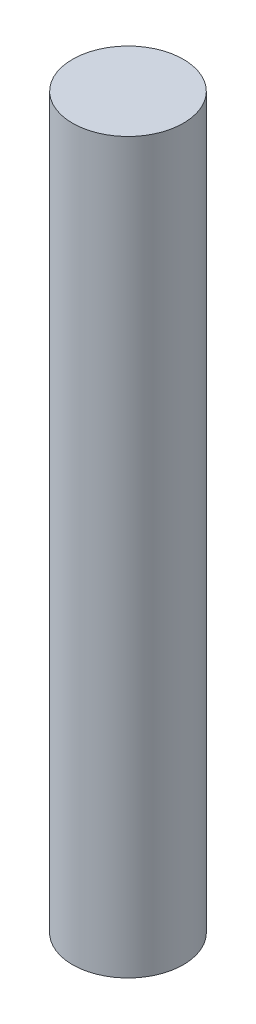
ISO-10303-21;
HEADER;
FILE_DESCRIPTION(('STEP AP214'),'2;1');
FILE_NAME('part.step','',(''),(''),'','','');
FILE_SCHEMA(('AUTOMOTIVE_DESIGN { 1 0 10303 214 1 1 1 1 }'));
ENDSEC;
DATA;
#1=APPLICATION_CONTEXT('core data for automotive mechanical design processes');
#2=APPLICATION_PROTOCOL_DEFINITION('international standard','automotive_design',2000,#1);
#3=PRODUCT_CONTEXT('',#1,'mechanical');
#4=PRODUCT('Part','Part','',(#3));
#5=PRODUCT_RELATED_PRODUCT_CATEGORY('part','',(#4));
#6=PRODUCT_DEFINITION_FORMATION('','',#4);
#7=PRODUCT_DEFINITION_CONTEXT('part definition',#1,'design');
#8=PRODUCT_DEFINITION('design','',#6,#7);
#9=PRODUCT_DEFINITION_SHAPE('','',#8);
#10=(LENGTH_UNIT() NAMED_UNIT(*) SI_UNIT(.MILLI.,.METRE.));
#11=(NAMED_UNIT(*) PLANE_ANGLE_UNIT() SI_UNIT($,.RADIAN.));
#12=(NAMED_UNIT(*) SI_UNIT($,.STERADIAN.) SOLID_ANGLE_UNIT());
#13=UNCERTAINTY_MEASURE_WITH_UNIT(LENGTH_MEASURE(1.E-05),#10,'distance_accuracy_value','');
#14=(GEOMETRIC_REPRESENTATION_CONTEXT(3) GLOBAL_UNCERTAINTY_ASSIGNED_CONTEXT((#13)) GLOBAL_UNIT_ASSIGNED_CONTEXT((#10,
#11,#12)) REPRESENTATION_CONTEXT('',''));
#15=CARTESIAN_POINT('',(0.,0.,0.));
#16=DIRECTION('',(0.,0.,1.));
#17=DIRECTION('',(1.,0.,0.));
#18=AXIS2_PLACEMENT_3D('',#15,#16,#17);
#19=CARTESIAN_POINT('',(0.,24.,0.));
#20=DIRECTION('',(0.,-1.,0.));
#21=DIRECTION('',(0.,0.,-1.));
#22=AXIS2_PLACEMENT_3D('',#19,#20,#21);
#23=CYLINDRICAL_SURFACE('',#22,1.825);
#24=CARTESIAN_POINT('',(0.,24.,0.));
#25=DIRECTION('',(0.,1.,0.));
#26=DIRECTION('',(0.,0.,1.));
#27=AXIS2_PLACEMENT_3D('',#24,#25,#26);
#28=CIRCLE('',#27,1.825);
#29=CARTESIAN_POINT('',(0.,24.,1.825));
#30=VERTEX_POINT('',#29);
#31=EDGE_CURVE('E10',#30,#30,#28,.T.);
#32=ORIENTED_EDGE('',*,*,#31,.F.);
#33=EDGE_LOOP('',(#32));
#34=FACE_BOUND('',#33,.T.);
#35=CARTESIAN_POINT('',(0.,0.,0.));
#36=DIRECTION('',(0.,1.,0.));
#37=DIRECTION('',(0.,0.,1.));
#38=AXIS2_PLACEMENT_3D('',#35,#36,#37);
#39=CIRCLE('',#38,1.825);
#40=CARTESIAN_POINT('',(0.,0.,1.825));
#41=VERTEX_POINT('',#40);
#42=EDGE_CURVE('E46',#41,#41,#39,.T.);
#43=ORIENTED_EDGE('',*,*,#42,.T.);
#44=EDGE_LOOP('',(#43));
#45=FACE_BOUND('',#44,.T.);
#46=ADVANCED_FACE('F43',(#34,#45),#23,.T.);
#47=CARTESIAN_POINT('',(0.,24.,0.));
#48=DIRECTION('',(0.,1.,0.));
#49=DIRECTION('',(0.,0.,1.));
#50=AXIS2_PLACEMENT_3D('',#47,#48,#49);
#51=PLANE('',#50);
#52=ORIENTED_EDGE('',*,*,#31,.T.);
#53=EDGE_LOOP('',(#52));
#54=FACE_BOUND('',#53,.T.);
#55=ADVANCED_FACE('F60',(#54),#51,.T.);
#56=CARTESIAN_POINT('',(0.,0.,0.));
#57=DIRECTION('',(0.,1.,0.));
#58=DIRECTION('',(0.,0.,1.));
#59=AXIS2_PLACEMENT_3D('',#56,#57,#58);
#60=PLANE('',#59);
#61=ORIENTED_EDGE('',*,*,#42,.F.);
#62=EDGE_LOOP('',(#61));
#63=FACE_BOUND('',#62,.T.);
#64=ADVANCED_FACE('F58',(#63),#60,.F.);
#65=CLOSED_SHELL('',(#46,#55,#64));
#66=MANIFOLD_SOLID_BREP('B2',#65);
#67=ADVANCED_BREP_SHAPE_REPRESENTATION('',(#18,#66),#14);
#68=SHAPE_DEFINITION_REPRESENTATION(#9,#67);
ENDSEC;
END-ISO-10303-21;
